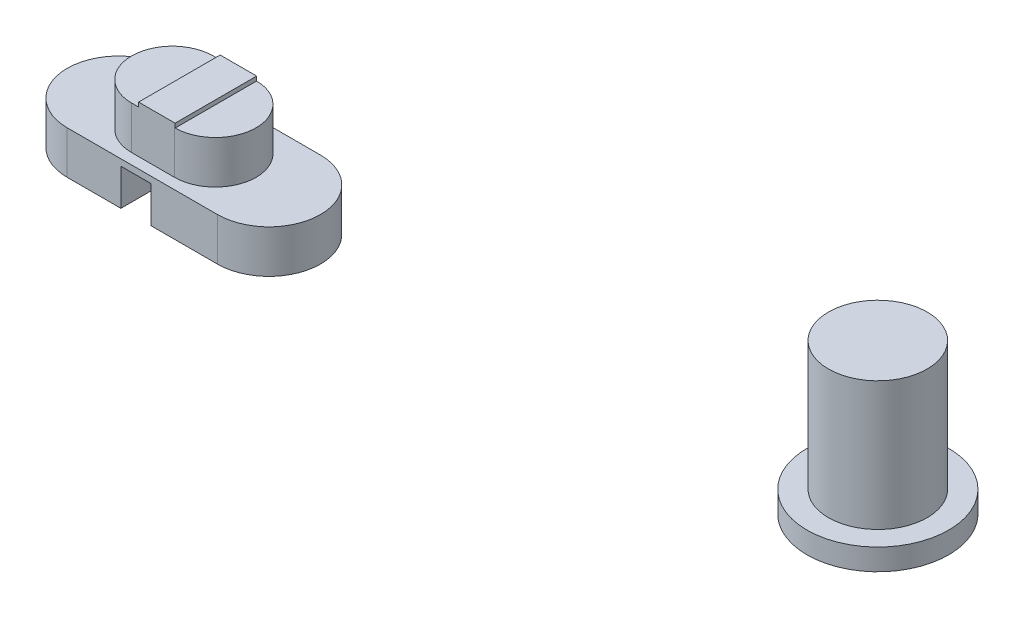
ISO-10303-21;
HEADER;
FILE_DESCRIPTION(('STEP AP214'),'2;1');
FILE_NAME('part.step','',(''),(''),'','','');
FILE_SCHEMA(('AUTOMOTIVE_DESIGN { 1 0 10303 214 1 1 1 1 }'));
ENDSEC;
DATA;
#1=APPLICATION_CONTEXT('core data for automotive mechanical design processes');
#2=APPLICATION_PROTOCOL_DEFINITION('international standard','automotive_design',2000,#1);
#3=PRODUCT_CONTEXT('',#1,'mechanical');
#4=PRODUCT('Part','Part','',(#3));
#5=PRODUCT_RELATED_PRODUCT_CATEGORY('part','',(#4));
#6=PRODUCT_DEFINITION_FORMATION('','',#4);
#7=PRODUCT_DEFINITION_CONTEXT('part definition',#1,'design');
#8=PRODUCT_DEFINITION('design','',#6,#7);
#9=PRODUCT_DEFINITION_SHAPE('','',#8);
#10=(LENGTH_UNIT() NAMED_UNIT(*) SI_UNIT(.MILLI.,.METRE.));
#11=(NAMED_UNIT(*) PLANE_ANGLE_UNIT() SI_UNIT($,.RADIAN.));
#12=(NAMED_UNIT(*) SI_UNIT($,.STERADIAN.) SOLID_ANGLE_UNIT());
#13=UNCERTAINTY_MEASURE_WITH_UNIT(LENGTH_MEASURE(1.E-05),#10,'distance_accuracy_value','');
#14=(GEOMETRIC_REPRESENTATION_CONTEXT(3) GLOBAL_UNCERTAINTY_ASSIGNED_CONTEXT((#13)) GLOBAL_UNIT_ASSIGNED_CONTEXT((#10,
#11,#12)) REPRESENTATION_CONTEXT('',''));
#15=CARTESIAN_POINT('',(0.,0.,0.));
#16=DIRECTION('',(0.,0.,1.));
#17=DIRECTION('',(1.,0.,0.));
#18=AXIS2_PLACEMENT_3D('',#15,#16,#17);
#19=CARTESIAN_POINT('',(0.,2.,0.));
#20=DIRECTION('',(0.,1.,0.));
#21=DIRECTION('',(0.,0.,1.));
#22=AXIS2_PLACEMENT_3D('',#19,#20,#21);
#23=PLANE('',#22);
#24=DIRECTION('',(0.,0.,-1.));
#25=VECTOR('',#24,1.);
#26=CARTESIAN_POINT('',(-28.9382166880969,2.,0.));
#27=LINE('',#26,#25);
#28=CARTESIAN_POINT('',(-28.9382166880969,2.,3.7998228433708));
#29=VERTEX_POINT('',#28);
#30=CARTESIAN_POINT('',(-28.9382166880969,2.,0.000177156629198403));
#31=VERTEX_POINT('',#30);
#32=EDGE_CURVE('E12',#29,#31,#27,.T.);
#33=ORIENTED_EDGE('',*,*,#32,.F.);
#34=CARTESIAN_POINT('',(-28.9641620885848,2.,1.9));
#35=DIRECTION('',(0.,1.,0.));
#36=DIRECTION('',(0.,0.,1.));
#37=AXIS2_PLACEMENT_3D('',#34,#35,#36);
#38=CIRCLE('',#37,1.9);
#39=EDGE_CURVE('E62',#31,#29,#38,.F.);
#40=ORIENTED_EDGE('',*,*,#39,.F.);
#41=EDGE_LOOP('',(#33,#40));
#42=FACE_BOUND('',#41,.T.);
#43=ADVANCED_FACE('F43',(#42),#23,.T.);
#44=CARTESIAN_POINT('',(0.,-2.,0.));
#45=DIRECTION('',(0.,1.,0.));
#46=DIRECTION('',(0.,0.,1.));
#47=AXIS2_PLACEMENT_3D('',#44,#45,#46);
#48=PLANE('',#47);
#49=DIRECTION('',(1.,0.,0.));
#50=VECTOR('',#49,1.);
#51=CARTESIAN_POINT('',(0.,-2.,-0.500000000000008));
#52=LINE('',#51,#50);
#53=CARTESIAN_POINT('',(-33.4641620885848,-2.,-0.500000000000008));
#54=VERTEX_POINT('',#53);
#55=CARTESIAN_POINT('',(-30.9641620885848,-2.,-0.500000000000008));
#56=VERTEX_POINT('',#55);
#57=EDGE_CURVE('E265',#54,#56,#52,.T.);
#58=ORIENTED_EDGE('',*,*,#57,.T.);
#59=DIRECTION('',(0.,0.,-1.));
#60=VECTOR('',#59,1.);
#61=CARTESIAN_POINT('',(-30.9641620885848,-2.,4.3));
#62=LINE('',#61,#60);
#63=CARTESIAN_POINT('',(-30.9641620885848,-2.,4.3));
#64=VERTEX_POINT('',#63);
#65=EDGE_CURVE('E213',#64,#56,#62,.T.);
#66=ORIENTED_EDGE('',*,*,#65,.F.);
#67=DIRECTION('',(1.,0.,0.));
#68=VECTOR('',#67,1.);
#69=CARTESIAN_POINT('',(0.,-2.,4.29999999999999));
#70=LINE('',#69,#68);
#71=CARTESIAN_POINT('',(-33.4641620885848,-2.,4.29999999999999));
#72=VERTEX_POINT('',#71);
#73=EDGE_CURVE('E258',#72,#64,#70,.T.);
#74=ORIENTED_EDGE('',*,*,#73,.F.);
#75=CARTESIAN_POINT('',(-33.4641620885848,-2.,1.9));
#76=DIRECTION('',(0.,1.,0.));
#77=DIRECTION('',(0.,0.,1.));
#78=AXIS2_PLACEMENT_3D('',#75,#76,#77);
#79=CIRCLE('',#78,2.4);
#80=EDGE_CURVE('E253',#72,#54,#79,.F.);
#81=ORIENTED_EDGE('',*,*,#80,.T.);
#82=EDGE_LOOP('',(#58,#66,#74,#81));
#83=FACE_BOUND('',#82,.T.);
#84=ADVANCED_FACE('F303',(#83),#48,.F.);
#85=CARTESIAN_POINT('',(-33.4641620885848,-2.,1.9));
#86=DIRECTION('',(0.,1.,0.));
#87=DIRECTION('',(0.,0.,1.));
#88=AXIS2_PLACEMENT_3D('',#85,#86,#87);
#89=CYLINDRICAL_SURFACE('',#88,2.4);
#90=CARTESIAN_POINT('',(-33.4641620885848,0.,1.9));
#91=DIRECTION('',(0.,1.,0.));
#92=DIRECTION('',(0.,0.,1.));
#93=AXIS2_PLACEMENT_3D('',#90,#91,#92);
#94=CIRCLE('',#93,2.4);
#95=CARTESIAN_POINT('',(-33.4641620885848,0.,4.29999999999999));
#96=VERTEX_POINT('',#95);
#97=CARTESIAN_POINT('',(-33.4641620885848,0.,-0.500000000000008));
#98=VERTEX_POINT('',#97);
#99=EDGE_CURVE('E252',#96,#98,#94,.F.);
#100=ORIENTED_EDGE('',*,*,#99,.T.);
#101=DIRECTION('',(0.,1.,0.));
#102=VECTOR('',#101,1.);
#103=CARTESIAN_POINT('',(-33.4641620885848,-2.,-0.500000000000008));
#104=LINE('',#103,#102);
#105=EDGE_CURVE('E52',#54,#98,#104,.T.);
#106=ORIENTED_EDGE('',*,*,#105,.F.);
#107=ORIENTED_EDGE('',*,*,#80,.F.);
#108=DIRECTION('',(0.,1.,0.));
#109=VECTOR('',#108,1.);
#110=CARTESIAN_POINT('',(-33.4641620885848,-2.,4.29999999999999));
#111=LINE('',#110,#109);
#112=EDGE_CURVE('E47',#72,#96,#111,.T.);
#113=ORIENTED_EDGE('',*,*,#112,.T.);
#114=EDGE_LOOP('',(#100,#106,#107,#113));
#115=FACE_BOUND('',#114,.T.);
#116=ADVANCED_FACE('F45',(#115),#89,.T.);
#117=CARTESIAN_POINT('',(0.,-2.,-0.500000000000008));
#118=DIRECTION('',(0.,0.,1.));
#119=DIRECTION('',(1.,0.,0.));
#120=AXIS2_PLACEMENT_3D('',#117,#118,#119);
#121=PLANE('',#120);
#122=DIRECTION('',(1.,0.,0.));
#123=VECTOR('',#122,1.);
#124=CARTESIAN_POINT('',(-30.9641620885848,-0.3,-0.500000000000008));
#125=LINE('',#124,#123);
#126=CARTESIAN_POINT('',(-30.9641620885848,-0.3,-0.500000000000008));
#127=VERTEX_POINT('',#126);
#128=CARTESIAN_POINT('',(-29.5641620885848,-0.3,-0.500000000000008));
#129=VERTEX_POINT('',#128);
#130=EDGE_CURVE('E193',#127,#129,#125,.T.);
#131=ORIENTED_EDGE('',*,*,#130,.F.);
#132=DIRECTION('',(0.,1.,0.));
#133=VECTOR('',#132,1.);
#134=CARTESIAN_POINT('',(-30.9641620885848,-2.,-0.500000000000008));
#135=LINE('',#134,#133);
#136=EDGE_CURVE('E190',#56,#127,#135,.T.);
#137=ORIENTED_EDGE('',*,*,#136,.F.);
#138=ORIENTED_EDGE('',*,*,#57,.F.);
#139=ORIENTED_EDGE('',*,*,#105,.T.);
#140=DIRECTION('',(1.,0.,0.));
#141=VECTOR('',#140,1.);
#142=CARTESIAN_POINT('',(0.,0.,-0.500000000000008));
#143=LINE('',#142,#141);
#144=CARTESIAN_POINT('',(-26.4641620885848,0.,-0.500000000000008));
#145=VERTEX_POINT('',#144);
#146=EDGE_CURVE('E257',#98,#145,#143,.T.);
#147=ORIENTED_EDGE('',*,*,#146,.T.);
#148=DIRECTION('',(0.,1.,0.));
#149=VECTOR('',#148,1.);
#150=CARTESIAN_POINT('',(-26.4641620885848,-2.,-0.500000000000008));
#151=LINE('',#150,#149);
#152=CARTESIAN_POINT('',(-26.4641620885848,-2.,-0.500000000000008));
#153=VERTEX_POINT('',#152);
#154=EDGE_CURVE('E279',#153,#145,#151,.T.);
#155=ORIENTED_EDGE('',*,*,#154,.F.);
#156=CARTESIAN_POINT('',(-29.5641620885848,-2.,-0.500000000000008));
#157=VERTEX_POINT('',#156);
#158=EDGE_CURVE('E264',#157,#153,#52,.T.);
#159=ORIENTED_EDGE('',*,*,#158,.F.);
#160=DIRECTION('',(0.,-1.,0.));
#161=VECTOR('',#160,1.);
#162=CARTESIAN_POINT('',(-29.5641620885848,-2.,-0.500000000000008));
#163=LINE('',#162,#161);
#164=EDGE_CURVE('E203',#129,#157,#163,.T.);
#165=ORIENTED_EDGE('',*,*,#164,.F.);
#166=EDGE_LOOP('',(#131,#137,#138,#139,#147,#155,#159,#165));
#167=FACE_BOUND('',#166,.T.);
#168=ADVANCED_FACE('F304',(#167),#121,.F.);
#169=CARTESIAN_POINT('',(-26.4641620885848,-2.,1.9));
#170=DIRECTION('',(0.,1.,0.));
#171=DIRECTION('',(0.,0.,1.));
#172=AXIS2_PLACEMENT_3D('',#169,#170,#171);
#173=CYLINDRICAL_SURFACE('',#172,2.4);
#174=CARTESIAN_POINT('',(-26.4641620885848,0.,1.9));
#175=DIRECTION('',(0.,1.,0.));
#176=DIRECTION('',(0.,0.,1.));
#177=AXIS2_PLACEMENT_3D('',#174,#175,#176);
#178=CIRCLE('',#177,2.4);
#179=CARTESIAN_POINT('',(-26.4641620885848,0.,4.29999999999999));
#180=VERTEX_POINT('',#179);
#181=EDGE_CURVE('E273',#145,#180,#178,.F.);
#182=ORIENTED_EDGE('',*,*,#181,.T.);
#183=DIRECTION('',(0.,1.,0.));
#184=VECTOR('',#183,1.);
#185=CARTESIAN_POINT('',(-26.4641620885848,-2.,4.29999999999999));
#186=LINE('',#185,#184);
#187=CARTESIAN_POINT('',(-26.4641620885848,-2.,4.29999999999999));
#188=VERTEX_POINT('',#187);
#189=EDGE_CURVE('E281',#188,#180,#186,.T.);
#190=ORIENTED_EDGE('',*,*,#189,.F.);
#191=CARTESIAN_POINT('',(-26.4641620885848,-2.,1.9));
#192=DIRECTION('',(0.,1.,0.));
#193=DIRECTION('',(0.,0.,1.));
#194=AXIS2_PLACEMENT_3D('',#191,#192,#193);
#195=CIRCLE('',#194,2.4);
#196=EDGE_CURVE('E261',#153,#188,#195,.F.);
#197=ORIENTED_EDGE('',*,*,#196,.F.);
#198=ORIENTED_EDGE('',*,*,#154,.T.);
#199=EDGE_LOOP('',(#182,#190,#197,#198));
#200=FACE_BOUND('',#199,.T.);
#201=ADVANCED_FACE('F296',(#200),#173,.T.);
#202=CARTESIAN_POINT('',(0.,-2.,4.29999999999999));
#203=DIRECTION('',(0.,0.,1.));
#204=DIRECTION('',(1.,0.,0.));
#205=AXIS2_PLACEMENT_3D('',#202,#203,#204);
#206=PLANE('',#205);
#207=DIRECTION('',(0.,1.,0.));
#208=VECTOR('',#207,1.);
#209=CARTESIAN_POINT('',(-30.9641620885848,-2.,4.3));
#210=LINE('',#209,#208);
#211=CARTESIAN_POINT('',(-30.9641620885848,-0.3,4.3));
#212=VERTEX_POINT('',#211);
#213=EDGE_CURVE('E199',#64,#212,#210,.T.);
#214=ORIENTED_EDGE('',*,*,#213,.T.);
#215=DIRECTION('',(1.,0.,0.));
#216=VECTOR('',#215,1.);
#217=CARTESIAN_POINT('',(-30.9641620885848,-0.3,4.3));
#218=LINE('',#217,#216);
#219=CARTESIAN_POINT('',(-29.5641620885848,-0.3,4.3));
#220=VERTEX_POINT('',#219);
#221=EDGE_CURVE('E202',#212,#220,#218,.T.);
#222=ORIENTED_EDGE('',*,*,#221,.T.);
#223=DIRECTION('',(0.,-1.,0.));
#224=VECTOR('',#223,1.);
#225=CARTESIAN_POINT('',(-29.5641620885848,-2.,4.3));
#226=LINE('',#225,#224);
#227=CARTESIAN_POINT('',(-29.5641620885848,-2.,4.3));
#228=VERTEX_POINT('',#227);
#229=EDGE_CURVE('E206',#220,#228,#226,.T.);
#230=ORIENTED_EDGE('',*,*,#229,.T.);
#231=EDGE_CURVE('E256',#228,#188,#70,.T.);
#232=ORIENTED_EDGE('',*,*,#231,.T.);
#233=ORIENTED_EDGE('',*,*,#189,.T.);
#234=DIRECTION('',(1.,0.,0.));
#235=VECTOR('',#234,1.);
#236=CARTESIAN_POINT('',(0.,0.,4.29999999999999));
#237=LINE('',#236,#235);
#238=EDGE_CURVE('E270',#96,#180,#237,.T.);
#239=ORIENTED_EDGE('',*,*,#238,.F.);
#240=ORIENTED_EDGE('',*,*,#112,.F.);
#241=ORIENTED_EDGE('',*,*,#73,.T.);
#242=EDGE_LOOP('',(#214,#222,#230,#232,#233,#239,#240,#241));
#243=FACE_BOUND('',#242,.T.);
#244=ADVANCED_FACE('F293',(#243),#206,.T.);
#245=ORIENTED_EDGE('',*,*,#231,.F.);
#246=DIRECTION('',(0.,0.,-1.));
#247=VECTOR('',#246,1.);
#248=CARTESIAN_POINT('',(-29.5641620885848,-2.,4.3));
#249=LINE('',#248,#247);
#250=EDGE_CURVE('E216',#228,#157,#249,.T.);
#251=ORIENTED_EDGE('',*,*,#250,.T.);
#252=ORIENTED_EDGE('',*,*,#158,.T.);
#253=ORIENTED_EDGE('',*,*,#196,.T.);
#254=EDGE_LOOP('',(#245,#251,#252,#253));
#255=FACE_BOUND('',#254,.T.);
#256=ADVANCED_FACE('F295',(#255),#48,.F.);
#257=CARTESIAN_POINT('',(0.,0.,0.));
#258=DIRECTION('',(0.,1.,0.));
#259=DIRECTION('',(0.,0.,1.));
#260=AXIS2_PLACEMENT_3D('',#257,#258,#259);
#261=PLANE('',#260);
#262=DIRECTION('',(1.,0.,0.));
#263=VECTOR('',#262,1.);
#264=CARTESIAN_POINT('',(0.,0.,0.));
#265=LINE('',#264,#263);
#266=CARTESIAN_POINT('',(-30.9641620885848,0.,0.));
#267=VERTEX_POINT('',#266);
#268=CARTESIAN_POINT('',(-28.9641620885848,0.,0.));
#269=VERTEX_POINT('',#268);
#270=EDGE_CURVE('E215',#267,#269,#265,.T.);
#271=ORIENTED_EDGE('',*,*,#270,.T.);
#272=CARTESIAN_POINT('',(-28.9641620885848,0.,1.9));
#273=DIRECTION('',(0.,1.,0.));
#274=DIRECTION('',(0.,0.,1.));
#275=AXIS2_PLACEMENT_3D('',#272,#273,#274);
#276=CIRCLE('',#275,1.9);
#277=CARTESIAN_POINT('',(-28.9641620885848,0.,3.8));
#278=VERTEX_POINT('',#277);
#279=EDGE_CURVE('E225',#269,#278,#276,.F.);
#280=ORIENTED_EDGE('',*,*,#279,.T.);
#281=DIRECTION('',(1.,0.,0.));
#282=VECTOR('',#281,1.);
#283=CARTESIAN_POINT('',(0.,0.,3.79999999999999));
#284=LINE('',#283,#282);
#285=CARTESIAN_POINT('',(-30.9641620885848,0.,3.8));
#286=VERTEX_POINT('',#285);
#287=EDGE_CURVE('E237',#286,#278,#284,.T.);
#288=ORIENTED_EDGE('',*,*,#287,.F.);
#289=CARTESIAN_POINT('',(-30.9641620885848,0.,1.9));
#290=DIRECTION('',(0.,1.,0.));
#291=DIRECTION('',(0.,0.,1.));
#292=AXIS2_PLACEMENT_3D('',#289,#290,#291);
#293=CIRCLE('',#292,1.9);
#294=EDGE_CURVE('E234',#267,#286,#293,.T.);
#295=ORIENTED_EDGE('',*,*,#294,.F.);
#296=EDGE_LOOP('',(#271,#280,#288,#295));
#297=FACE_BOUND('',#296,.T.);
#298=ORIENTED_EDGE('',*,*,#99,.F.);
#299=ORIENTED_EDGE('',*,*,#238,.T.);
#300=ORIENTED_EDGE('',*,*,#181,.F.);
#301=ORIENTED_EDGE('',*,*,#146,.F.);
#302=EDGE_LOOP('',(#298,#299,#300,#301));
#303=FACE_BOUND('',#302,.T.);
#304=ADVANCED_FACE('F291',(#297,#303),#261,.T.);
#305=CARTESIAN_POINT('',(0.,2.,0.));
#306=DIRECTION('',(0.,0.,-1.));
#307=DIRECTION('',(-1.,0.,0.));
#308=AXIS2_PLACEMENT_3D('',#305,#306,#307);
#309=PLANE('',#308);
#310=ORIENTED_EDGE('',*,*,#270,.F.);
#311=DIRECTION('',(0.,-1.,0.));
#312=VECTOR('',#311,1.);
#313=CARTESIAN_POINT('',(-30.9641620885848,2.,0.));
#314=LINE('',#313,#312);
#315=CARTESIAN_POINT('',(-30.9641620885848,2.,0.));
#316=VERTEX_POINT('',#315);
#317=EDGE_CURVE('E249',#316,#267,#314,.T.);
#318=ORIENTED_EDGE('',*,*,#317,.F.);
#319=DIRECTION('',(1.,0.,0.));
#320=VECTOR('',#319,1.);
#321=CARTESIAN_POINT('',(0.,2.,0.));
#322=LINE('',#321,#320);
#323=CARTESIAN_POINT('',(-30.6386819625502,2.,0.));
#324=VERTEX_POINT('',#323);
#325=EDGE_CURVE('E222',#316,#324,#322,.T.);
#326=ORIENTED_EDGE('',*,*,#325,.T.);
#327=DIRECTION('',(0.,-1.,0.));
#328=VECTOR('',#327,1.);
#329=CARTESIAN_POINT('',(-30.6386819625502,2.2,0.));
#330=LINE('',#329,#328);
#331=CARTESIAN_POINT('',(-30.6386819625502,2.2,0.));
#332=VERTEX_POINT('',#331);
#333=EDGE_CURVE('E171',#332,#324,#330,.T.);
#334=ORIENTED_EDGE('',*,*,#333,.F.);
#335=DIRECTION('',(-1.,0.,0.));
#336=VECTOR('',#335,1.);
#337=CARTESIAN_POINT('',(-28.9382166880969,2.2,0.));
#338=LINE('',#337,#336);
#339=CARTESIAN_POINT('',(-28.9382166880969,2.2,0.));
#340=VERTEX_POINT('',#339);
#341=EDGE_CURVE('E162',#340,#332,#338,.T.);
#342=ORIENTED_EDGE('',*,*,#341,.F.);
#343=DIRECTION('',(0.,-1.,0.));
#344=VECTOR('',#343,1.);
#345=CARTESIAN_POINT('',(-28.9382166880969,2.2,0.));
#346=LINE('',#345,#344);
#347=CARTESIAN_POINT('',(-28.9382166880969,2.,0.));
#348=VERTEX_POINT('',#347);
#349=EDGE_CURVE('E168',#340,#348,#346,.T.);
#350=ORIENTED_EDGE('',*,*,#349,.T.);
#351=DIRECTION('',(-1.,0.,0.));
#352=VECTOR('',#351,1.);
#353=CARTESIAN_POINT('',(-28.9382166880969,2.,0.));
#354=LINE('',#353,#352);
#355=CARTESIAN_POINT('',(-28.9641620885848,2.,0.));
#356=VERTEX_POINT('',#355);
#357=EDGE_CURVE('E335',#348,#356,#354,.T.);
#358=ORIENTED_EDGE('',*,*,#357,.T.);
#359=DIRECTION('',(0.,-1.,0.));
#360=VECTOR('',#359,1.);
#361=CARTESIAN_POINT('',(-28.9641620885848,2.,0.));
#362=LINE('',#361,#360);
#363=EDGE_CURVE('E232',#356,#269,#362,.T.);
#364=ORIENTED_EDGE('',*,*,#363,.T.);
#365=EDGE_LOOP('',(#310,#318,#326,#334,#342,#350,#358,#364));
#366=FACE_BOUND('',#365,.T.);
#367=ADVANCED_FACE('F165',(#366),#309,.T.);
#368=CARTESIAN_POINT('',(-30.9641620885848,2.,1.9));
#369=DIRECTION('',(0.,-1.,0.));
#370=DIRECTION('',(0.,0.,-1.));
#371=AXIS2_PLACEMENT_3D('',#368,#369,#370);
#372=CYLINDRICAL_SURFACE('',#371,1.9);
#373=ORIENTED_EDGE('',*,*,#294,.T.);
#374=DIRECTION('',(0.,-1.,0.));
#375=VECTOR('',#374,1.);
#376=CARTESIAN_POINT('',(-30.9641620885848,2.,3.8));
#377=LINE('',#376,#375);
#378=CARTESIAN_POINT('',(-30.9641620885848,2.,3.8));
#379=VERTEX_POINT('',#378);
#380=EDGE_CURVE('E246',#379,#286,#377,.T.);
#381=ORIENTED_EDGE('',*,*,#380,.F.);
#382=CARTESIAN_POINT('',(-30.9641620885848,2.,1.9));
#383=DIRECTION('',(0.,1.,0.));
#384=DIRECTION('',(0.,0.,1.));
#385=AXIS2_PLACEMENT_3D('',#382,#383,#384);
#386=CIRCLE('',#385,1.9);
#387=EDGE_CURVE('E224',#316,#379,#386,.T.);
#388=ORIENTED_EDGE('',*,*,#387,.F.);
#389=ORIENTED_EDGE('',*,*,#317,.T.);
#390=EDGE_LOOP('',(#373,#381,#388,#389));
#391=FACE_BOUND('',#390,.T.);
#392=ADVANCED_FACE('F359',(#391),#372,.T.);
#393=CARTESIAN_POINT('',(0.,2.,3.79999999999999));
#394=DIRECTION('',(0.,0.,-1.));
#395=DIRECTION('',(-1.,0.,0.));
#396=AXIS2_PLACEMENT_3D('',#393,#394,#395);
#397=PLANE('',#396);
#398=ORIENTED_EDGE('',*,*,#287,.T.);
#399=DIRECTION('',(0.,-1.,0.));
#400=VECTOR('',#399,1.);
#401=CARTESIAN_POINT('',(-28.9641620885848,2.,3.8));
#402=LINE('',#401,#400);
#403=CARTESIAN_POINT('',(-28.9641620885848,2.,3.8));
#404=VERTEX_POINT('',#403);
#405=EDGE_CURVE('E243',#404,#278,#402,.T.);
#406=ORIENTED_EDGE('',*,*,#405,.F.);
#407=DIRECTION('',(1.,0.,0.));
#408=VECTOR('',#407,1.);
#409=CARTESIAN_POINT('',(-28.9382166880969,2.,3.8));
#410=LINE('',#409,#408);
#411=CARTESIAN_POINT('',(-28.9382166880969,2.,3.8));
#412=VERTEX_POINT('',#411);
#413=EDGE_CURVE('E184',#404,#412,#410,.T.);
#414=ORIENTED_EDGE('',*,*,#413,.T.);
#415=DIRECTION('',(0.,-1.,0.));
#416=VECTOR('',#415,1.);
#417=CARTESIAN_POINT('',(-28.9382166880969,2.2,3.8));
#418=LINE('',#417,#416);
#419=CARTESIAN_POINT('',(-28.9382166880969,2.2,3.8));
#420=VERTEX_POINT('',#419);
#421=EDGE_CURVE('E340',#420,#412,#418,.T.);
#422=ORIENTED_EDGE('',*,*,#421,.F.);
#423=DIRECTION('',(1.,0.,0.));
#424=VECTOR('',#423,1.);
#425=CARTESIAN_POINT('',(-28.9382166880969,2.2,3.8));
#426=LINE('',#425,#424);
#427=CARTESIAN_POINT('',(-30.6386819625502,2.2,3.8));
#428=VERTEX_POINT('',#427);
#429=EDGE_CURVE('E180',#428,#420,#426,.T.);
#430=ORIENTED_EDGE('',*,*,#429,.F.);
#431=DIRECTION('',(0.,-1.,0.));
#432=VECTOR('',#431,1.);
#433=CARTESIAN_POINT('',(-30.6386819625502,2.2,3.8));
#434=LINE('',#433,#432);
#435=CARTESIAN_POINT('',(-30.6386819625502,2.,3.8));
#436=VERTEX_POINT('',#435);
#437=EDGE_CURVE('E195',#428,#436,#434,.T.);
#438=ORIENTED_EDGE('',*,*,#437,.T.);
#439=DIRECTION('',(1.,0.,0.));
#440=VECTOR('',#439,1.);
#441=CARTESIAN_POINT('',(0.,2.,3.79999999999999));
#442=LINE('',#441,#440);
#443=EDGE_CURVE('E227',#379,#436,#442,.T.);
#444=ORIENTED_EDGE('',*,*,#443,.F.);
#445=ORIENTED_EDGE('',*,*,#380,.T.);
#446=EDGE_LOOP('',(#398,#406,#414,#422,#430,#438,#444,#445));
#447=FACE_BOUND('',#446,.T.);
#448=ADVANCED_FACE('F326',(#447),#397,.F.);
#449=CARTESIAN_POINT('',(-28.9641620885848,2.,1.9));
#450=DIRECTION('',(0.,-1.,0.));
#451=DIRECTION('',(0.,0.,-1.));
#452=AXIS2_PLACEMENT_3D('',#449,#450,#451);
#453=CYLINDRICAL_SURFACE('',#452,1.9);
#454=ORIENTED_EDGE('',*,*,#279,.F.);
#455=ORIENTED_EDGE('',*,*,#363,.F.);
#456=EDGE_CURVE('E230',#356,#31,#38,.F.);
#457=ORIENTED_EDGE('',*,*,#456,.T.);
#458=ORIENTED_EDGE('',*,*,#39,.T.);
#459=EDGE_CURVE('E229',#29,#404,#38,.F.);
#460=ORIENTED_EDGE('',*,*,#459,.T.);
#461=ORIENTED_EDGE('',*,*,#405,.T.);
#462=EDGE_LOOP('',(#454,#455,#457,#458,#460,#461));
#463=FACE_BOUND('',#462,.T.);
#464=ADVANCED_FACE('F318',(#463),#453,.T.);
#465=DIRECTION('',(0.,0.,1.));
#466=VECTOR('',#465,1.);
#467=CARTESIAN_POINT('',(-30.6386819625502,2.,0.));
#468=LINE('',#467,#466);
#469=EDGE_CURVE('E330',#324,#436,#468,.T.);
#470=ORIENTED_EDGE('',*,*,#469,.F.);
#471=ORIENTED_EDGE('',*,*,#325,.F.);
#472=ORIENTED_EDGE('',*,*,#387,.T.);
#473=ORIENTED_EDGE('',*,*,#443,.T.);
#474=EDGE_LOOP('',(#470,#471,#472,#473));
#475=FACE_BOUND('',#474,.T.);
#476=ADVANCED_FACE('F309',(#475),#23,.T.);
#477=CARTESIAN_POINT('',(-30.9641620885848,-2.,4.3));
#478=DIRECTION('',(-1.,0.,0.));
#479=DIRECTION('',(0.,0.,1.));
#480=AXIS2_PLACEMENT_3D('',#477,#478,#479);
#481=PLANE('',#480);
#482=ORIENTED_EDGE('',*,*,#136,.T.);
#483=DIRECTION('',(0.,0.,-1.));
#484=VECTOR('',#483,1.);
#485=CARTESIAN_POINT('',(-30.9641620885848,-0.3,4.3));
#486=LINE('',#485,#484);
#487=EDGE_CURVE('E208',#212,#127,#486,.T.);
#488=ORIENTED_EDGE('',*,*,#487,.F.);
#489=ORIENTED_EDGE('',*,*,#213,.F.);
#490=ORIENTED_EDGE('',*,*,#65,.T.);
#491=EDGE_LOOP('',(#482,#488,#489,#490));
#492=FACE_BOUND('',#491,.T.);
#493=ADVANCED_FACE('F317',(#492),#481,.F.);
#494=CARTESIAN_POINT('',(-29.5641620885848,-2.,4.3));
#495=DIRECTION('',(1.,0.,0.));
#496=DIRECTION('',(0.,0.,-1.));
#497=AXIS2_PLACEMENT_3D('',#494,#495,#496);
#498=PLANE('',#497);
#499=ORIENTED_EDGE('',*,*,#164,.T.);
#500=ORIENTED_EDGE('',*,*,#250,.F.);
#501=ORIENTED_EDGE('',*,*,#229,.F.);
#502=DIRECTION('',(0.,0.,-1.));
#503=VECTOR('',#502,1.);
#504=CARTESIAN_POINT('',(-29.5641620885848,-0.3,4.3));
#505=LINE('',#504,#503);
#506=EDGE_CURVE('E219',#220,#129,#505,.T.);
#507=ORIENTED_EDGE('',*,*,#506,.T.);
#508=EDGE_LOOP('',(#499,#500,#501,#507));
#509=FACE_BOUND('',#508,.T.);
#510=ADVANCED_FACE('F324',(#509),#498,.F.);
#511=CARTESIAN_POINT('',(-30.9641620885848,-0.3,4.3));
#512=DIRECTION('',(0.,1.,0.));
#513=DIRECTION('',(-1.,0.,0.));
#514=AXIS2_PLACEMENT_3D('',#511,#512,#513);
#515=PLANE('',#514);
#516=ORIENTED_EDGE('',*,*,#130,.T.);
#517=ORIENTED_EDGE('',*,*,#506,.F.);
#518=ORIENTED_EDGE('',*,*,#221,.F.);
#519=ORIENTED_EDGE('',*,*,#487,.T.);
#520=EDGE_LOOP('',(#516,#517,#518,#519));
#521=FACE_BOUND('',#520,.T.);
#522=ADVANCED_FACE('F381',(#521),#515,.F.);
#523=CARTESIAN_POINT('',(0.,2.,0.));
#524=DIRECTION('',(0.,-1.,0.));
#525=DIRECTION('',(0.,0.,-1.));
#526=AXIS2_PLACEMENT_3D('',#523,#524,#525);
#527=PLANE('',#526);
#528=ORIENTED_EDGE('',*,*,#456,.F.);
#529=ORIENTED_EDGE('',*,*,#357,.F.);
#530=EDGE_CURVE('E55',#31,#348,#27,.T.);
#531=ORIENTED_EDGE('',*,*,#530,.F.);
#532=EDGE_LOOP('',(#528,#529,#531));
#533=FACE_BOUND('',#532,.T.);
#534=ADVANCED_FACE('F355',(#533),#527,.T.);
#535=ORIENTED_EDGE('',*,*,#459,.F.);
#536=EDGE_CURVE('E54',#412,#29,#27,.T.);
#537=ORIENTED_EDGE('',*,*,#536,.F.);
#538=ORIENTED_EDGE('',*,*,#413,.F.);
#539=EDGE_LOOP('',(#535,#537,#538));
#540=FACE_BOUND('',#539,.T.);
#541=ADVANCED_FACE('F351',(#540),#527,.T.);
#542=CARTESIAN_POINT('',(-28.9382166880969,2.2,0.));
#543=DIRECTION('',(-1.,0.,0.));
#544=DIRECTION('',(0.,0.,1.));
#545=AXIS2_PLACEMENT_3D('',#542,#543,#544);
#546=PLANE('',#545);
#547=ORIENTED_EDGE('',*,*,#536,.T.);
#548=ORIENTED_EDGE('',*,*,#32,.T.);
#549=ORIENTED_EDGE('',*,*,#530,.T.);
#550=ORIENTED_EDGE('',*,*,#349,.F.);
#551=DIRECTION('',(0.,0.,-1.));
#552=VECTOR('',#551,1.);
#553=CARTESIAN_POINT('',(-28.9382166880969,2.2,0.));
#554=LINE('',#553,#552);
#555=EDGE_CURVE('E175',#420,#340,#554,.T.);
#556=ORIENTED_EDGE('',*,*,#555,.F.);
#557=ORIENTED_EDGE('',*,*,#421,.T.);
#558=EDGE_LOOP('',(#547,#548,#549,#550,#556,#557));
#559=FACE_BOUND('',#558,.T.);
#560=ADVANCED_FACE('F187',(#559),#546,.F.);
#561=CARTESIAN_POINT('',(-30.6386819625502,2.2,0.));
#562=DIRECTION('',(1.,0.,0.));
#563=DIRECTION('',(0.,0.,-1.));
#564=AXIS2_PLACEMENT_3D('',#561,#562,#563);
#565=PLANE('',#564);
#566=ORIENTED_EDGE('',*,*,#469,.T.);
#567=ORIENTED_EDGE('',*,*,#437,.F.);
#568=DIRECTION('',(0.,0.,1.));
#569=VECTOR('',#568,1.);
#570=CARTESIAN_POINT('',(-30.6386819625502,2.2,0.));
#571=LINE('',#570,#569);
#572=EDGE_CURVE('E174',#332,#428,#571,.T.);
#573=ORIENTED_EDGE('',*,*,#572,.F.);
#574=ORIENTED_EDGE('',*,*,#333,.T.);
#575=EDGE_LOOP('',(#566,#567,#573,#574));
#576=FACE_BOUND('',#575,.T.);
#577=ADVANCED_FACE('F338',(#576),#565,.F.);
#578=CARTESIAN_POINT('',(0.,2.2,0.));
#579=DIRECTION('',(0.,-1.,0.));
#580=DIRECTION('',(0.,0.,-1.));
#581=AXIS2_PLACEMENT_3D('',#578,#579,#580);
#582=PLANE('',#581);
#583=ORIENTED_EDGE('',*,*,#555,.T.);
#584=ORIENTED_EDGE('',*,*,#341,.T.);
#585=ORIENTED_EDGE('',*,*,#572,.T.);
#586=ORIENTED_EDGE('',*,*,#429,.T.);
#587=EDGE_LOOP('',(#583,#584,#585,#586));
#588=FACE_BOUND('',#587,.T.);
#589=ADVANCED_FACE('F178',(#588),#582,.F.);
#590=CLOSED_SHELL('',(#43,#84,#116,#168,#201,#244,#256,#304,#367,#392,#448,#464,#476,#493,#510,
#522,#534,#541,#560,#577,#589));
#591=MANIFOLD_SOLID_BREP('B2',#590);
#592=CARTESIAN_POINT('',(0.,-1.,0.));
#593=DIRECTION('',(0.,1.,0.));
#594=DIRECTION('',(0.,0.,1.));
#595=AXIS2_PLACEMENT_3D('',#592,#593,#594);
#596=CYLINDRICAL_SURFACE('',#595,3.3);
#597=CARTESIAN_POINT('',(0.,-1.,0.));
#598=DIRECTION('',(0.,1.,0.));
#599=DIRECTION('',(0.,0.,1.));
#600=AXIS2_PLACEMENT_3D('',#597,#598,#599);
#601=CIRCLE('',#600,3.3);
#602=CARTESIAN_POINT('',(0.,-1.,3.3));
#603=VERTEX_POINT('',#602);
#604=EDGE_CURVE('E42',#603,#603,#601,.T.);
#605=ORIENTED_EDGE('',*,*,#604,.T.);
#606=EDGE_LOOP('',(#605));
#607=FACE_BOUND('',#606,.T.);
#608=CARTESIAN_POINT('',(0.,0.,0.));
#609=DIRECTION('',(0.,1.,0.));
#610=DIRECTION('',(0.,0.,1.));
#611=AXIS2_PLACEMENT_3D('',#608,#609,#610);
#612=CIRCLE('',#611,3.3);
#613=CARTESIAN_POINT('',(0.,0.,3.3));
#614=VERTEX_POINT('',#613);
#615=EDGE_CURVE('E530',#614,#614,#612,.T.);
#616=ORIENTED_EDGE('',*,*,#615,.F.);
#617=EDGE_LOOP('',(#616));
#618=FACE_BOUND('',#617,.T.);
#619=ADVANCED_FACE('F527',(#607,#618),#596,.T.);
#620=CARTESIAN_POINT('',(0.,-1.,0.));
#621=DIRECTION('',(0.,1.,0.));
#622=DIRECTION('',(0.,0.,1.));
#623=AXIS2_PLACEMENT_3D('',#620,#621,#622);
#624=PLANE('',#623);
#625=ORIENTED_EDGE('',*,*,#604,.F.);
#626=EDGE_LOOP('',(#625));
#627=FACE_BOUND('',#626,.T.);
#628=ADVANCED_FACE('F556',(#627),#624,.F.);
#629=CARTESIAN_POINT('',(0.,0.,0.));
#630=DIRECTION('',(0.,1.,0.));
#631=DIRECTION('',(0.,0.,1.));
#632=AXIS2_PLACEMENT_3D('',#629,#630,#631);
#633=PLANE('',#632);
#634=CARTESIAN_POINT('',(0.,0.,0.));
#635=DIRECTION('',(0.,1.,0.));
#636=DIRECTION('',(0.,0.,1.));
#637=AXIS2_PLACEMENT_3D('',#634,#635,#636);
#638=CIRCLE('',#637,2.3);
#639=CARTESIAN_POINT('',(0.,0.,2.3));
#640=VERTEX_POINT('',#639);
#641=EDGE_CURVE('E539',#640,#640,#638,.T.);
#642=ORIENTED_EDGE('',*,*,#641,.F.);
#643=EDGE_LOOP('',(#642));
#644=FACE_BOUND('',#643,.T.);
#645=ORIENTED_EDGE('',*,*,#615,.T.);
#646=EDGE_LOOP('',(#645));
#647=FACE_BOUND('',#646,.T.);
#648=ADVANCED_FACE('F550',(#644,#647),#633,.T.);
#649=CARTESIAN_POINT('',(0.,6.,0.));
#650=DIRECTION('',(0.,-1.,0.));
#651=DIRECTION('',(0.,0.,-1.));
#652=AXIS2_PLACEMENT_3D('',#649,#650,#651);
#653=CYLINDRICAL_SURFACE('',#652,2.3);
#654=CARTESIAN_POINT('',(0.,6.,0.));
#655=DIRECTION('',(0.,1.,0.));
#656=DIRECTION('',(0.,0.,1.));
#657=AXIS2_PLACEMENT_3D('',#654,#655,#656);
#658=CIRCLE('',#657,2.3);
#659=CARTESIAN_POINT('',(0.,6.,2.3));
#660=VERTEX_POINT('',#659);
#661=EDGE_CURVE('E537',#660,#660,#658,.T.);
#662=ORIENTED_EDGE('',*,*,#661,.F.);
#663=EDGE_LOOP('',(#662));
#664=FACE_BOUND('',#663,.T.);
#665=ORIENTED_EDGE('',*,*,#641,.T.);
#666=EDGE_LOOP('',(#665));
#667=FACE_BOUND('',#666,.T.);
#668=ADVANCED_FACE('F547',(#664,#667),#653,.T.);
#669=CARTESIAN_POINT('',(0.,6.,0.));
#670=DIRECTION('',(0.,1.,0.));
#671=DIRECTION('',(0.,0.,1.));
#672=AXIS2_PLACEMENT_3D('',#669,#670,#671);
#673=PLANE('',#672);
#674=ORIENTED_EDGE('',*,*,#661,.T.);
#675=EDGE_LOOP('',(#674));
#676=FACE_BOUND('',#675,.T.);
#677=ADVANCED_FACE('F545',(#676),#673,.T.);
#678=CLOSED_SHELL('',(#619,#628,#648,#668,#677));
#679=MANIFOLD_SOLID_BREP('B6',#678);
#680=ADVANCED_BREP_SHAPE_REPRESENTATION('',(#18,#591,#679),#14);
#681=SHAPE_DEFINITION_REPRESENTATION(#9,#680);
ENDSEC;
END-ISO-10303-21;
